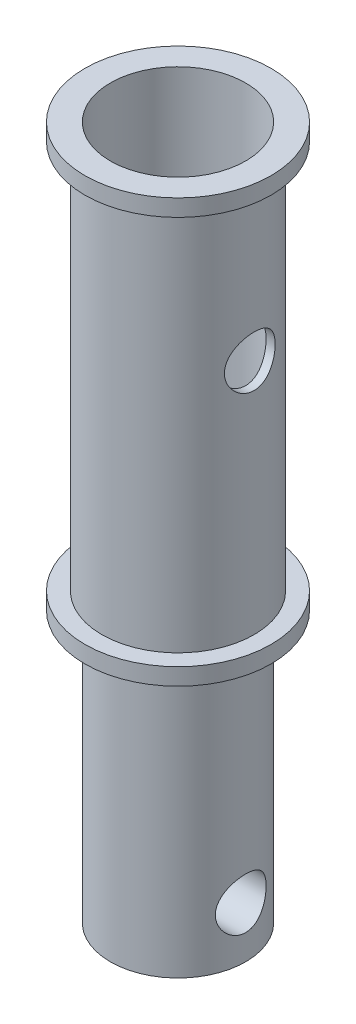
ISO-10303-21;
HEADER;
FILE_DESCRIPTION(('STEP AP214'),'2;1');
FILE_NAME('part.step','',(''),(''),'','','');
FILE_SCHEMA(('AUTOMOTIVE_DESIGN { 1 0 10303 214 1 1 1 1 }'));
ENDSEC;
DATA;
#1=APPLICATION_CONTEXT('core data for automotive mechanical design processes');
#2=APPLICATION_PROTOCOL_DEFINITION('international standard','automotive_design',2000,#1);
#3=PRODUCT_CONTEXT('',#1,'mechanical');
#4=PRODUCT('Part','Part','',(#3));
#5=PRODUCT_RELATED_PRODUCT_CATEGORY('part','',(#4));
#6=PRODUCT_DEFINITION_FORMATION('','',#4);
#7=PRODUCT_DEFINITION_CONTEXT('part definition',#1,'design');
#8=PRODUCT_DEFINITION('design','',#6,#7);
#9=PRODUCT_DEFINITION_SHAPE('','',#8);
#10=(LENGTH_UNIT() NAMED_UNIT(*) SI_UNIT(.MILLI.,.METRE.));
#11=(NAMED_UNIT(*) PLANE_ANGLE_UNIT() SI_UNIT($,.RADIAN.));
#12=(NAMED_UNIT(*) SI_UNIT($,.STERADIAN.) SOLID_ANGLE_UNIT());
#13=UNCERTAINTY_MEASURE_WITH_UNIT(LENGTH_MEASURE(1.E-05),#10,'distance_accuracy_value','');
#14=(GEOMETRIC_REPRESENTATION_CONTEXT(3) GLOBAL_UNCERTAINTY_ASSIGNED_CONTEXT((#13)) GLOBAL_UNIT_ASSIGNED_CONTEXT((#10,
#11,#12)) REPRESENTATION_CONTEXT('',''));
#15=CARTESIAN_POINT('',(0.,0.,0.));
#16=DIRECTION('',(0.,0.,1.));
#17=DIRECTION('',(1.,0.,0.));
#18=AXIS2_PLACEMENT_3D('',#15,#16,#17);
#19=CARTESIAN_POINT('',(0.,25.,0.));
#20=DIRECTION('',(0.,-1.,0.));
#21=DIRECTION('',(0.,0.,-1.));
#22=AXIS2_PLACEMENT_3D('',#19,#20,#21);
#23=CYLINDRICAL_SURFACE('',#22,4.5);
#24=CARTESIAN_POINT('',(-4.24264068711928,15.,-1.5));
#25=CARTESIAN_POINT('',(-4.24264041795651,15.0817022622541,-1.50000038692157));
#26=CARTESIAN_POINT('',(-4.24502653936286,15.1634021997354,-1.49330217552828));
#27=CARTESIAN_POINT('',(-4.25426361121882,15.3243816314914,-1.46677669753321));
#28=CARTESIAN_POINT('',(-4.26111529713283,15.4036607248087,-1.4469472682526));
#29=CARTESIAN_POINT('',(-4.27842305533187,15.5574403394959,-1.39493322852736));
#30=CARTESIAN_POINT('',(-4.28887205956983,15.6319498941641,-1.36277283210487));
#31=CARTESIAN_POINT('',(-4.31218683015487,15.7745400728219,-1.28709244266207));
#32=CARTESIAN_POINT('',(-4.32505312955418,15.8426192738304,-1.24356994329027));
#33=CARTESIAN_POINT('',(-4.3523173411121,15.9730799435075,-1.14457671966432));
#34=CARTESIAN_POINT('',(-4.36675342266966,16.0351731430076,-1.08873651206688));
#35=CARTESIAN_POINT('',(-4.39520797201504,16.149310201837,-0.967481500821593));
#36=CARTESIAN_POINT('',(-4.40922637243442,16.2013524473736,-0.902065162578564));
#37=CARTESIAN_POINT('',(-4.43570800382698,16.2952183459944,-0.761406761947516));
#38=CARTESIAN_POINT('',(-4.44812111552408,16.3367399559269,-0.685952866836789));
#39=CARTESIAN_POINT('',(-4.46954380156474,16.4063873776913,-0.528646834481211));
#40=CARTESIAN_POINT('',(-4.47855429304502,16.4345167997654,-0.446796428530818));
#41=CARTESIAN_POINT('',(-4.49188613147861,16.4756037819486,-0.282043226150241));
#42=CARTESIAN_POINT('',(-4.49635972166341,16.4890551693855,-0.199276132279451));
#43=CARTESIAN_POINT('',(-4.5006541232737,16.501974440041,-0.0325468122361348));
#44=CARTESIAN_POINT('',(-4.50047613394335,16.5014459274786,0.0514151003158411));
#45=CARTESIAN_POINT('',(-4.49559059428104,16.486733618151,0.214655272790728));
#46=CARTESIAN_POINT('',(-4.49106097132703,16.4730862072882,0.293988072887503));
#47=CARTESIAN_POINT('',(-4.47820451009571,16.4334105285293,0.449165158233243));
#48=CARTESIAN_POINT('',(-4.46987741446672,16.4073814215304,0.525009206668765));
#49=CARTESIAN_POINT('',(-4.45013505439938,16.3433680240408,0.672228712263021));
#50=CARTESIAN_POINT('',(-4.43868063786404,16.3052310921798,0.743532331453498));
#51=CARTESIAN_POINT('',(-4.41387589557997,16.2182104418274,0.878886488290755));
#52=CARTESIAN_POINT('',(-4.40052504300777,16.16932373501,0.942935001577155));
#53=CARTESIAN_POINT('',(-4.37259287776335,16.0594884098089,1.06515129982786));
#54=CARTESIAN_POINT('',(-4.35798322759,15.9980802632318,1.12290023560133));
#55=CARTESIAN_POINT('',(-4.32971002867667,15.866326911416,1.22741588939384));
#56=CARTESIAN_POINT('',(-4.31604662597175,15.7959803314301,1.27418091490951));
#57=CARTESIAN_POINT('',(-4.29105787703296,15.6470195615769,1.3559811825641));
#58=CARTESIAN_POINT('',(-4.27976864008232,15.5683018029483,1.39083969547657));
#59=CARTESIAN_POINT('',(-4.26122476317448,15.4056429086006,1.44666478994926));
#60=CARTESIAN_POINT('',(-4.25396843251835,15.3217039781673,1.46763719363329));
#61=CARTESIAN_POINT('',(-4.24469454453105,15.1550424668991,1.49424192313571));
#62=CARTESIAN_POINT('',(-4.24245540472709,15.0724358628814,1.50052364325862));
#63=CARTESIAN_POINT('',(-4.24285008094201,14.9073357763244,1.49940815836741));
#64=CARTESIAN_POINT('',(-4.24548301189152,14.8248422759629,1.49201343784089));
#65=CARTESIAN_POINT('',(-4.25510427134068,14.6652645514333,1.46433847732775));
#66=CARTESIAN_POINT('',(-4.2619398816089,14.588091854774,1.44450959097083));
#67=CARTESIAN_POINT('',(-4.27902830506905,14.4381845906409,1.39307079384089));
#68=CARTESIAN_POINT('',(-4.2892817240236,14.3654508126138,1.36145879454519));
#69=CARTESIAN_POINT('',(-4.31245316393576,14.2239293687296,1.28621151110835));
#70=CARTESIAN_POINT('',(-4.32544538498415,14.1553400360373,1.24222667753773));
#71=CARTESIAN_POINT('',(-4.35248653096476,14.0262809214244,1.14387844583635));
#72=CARTESIAN_POINT('',(-4.36653576665699,13.9658135420082,1.08951198824818));
#73=CARTESIAN_POINT('',(-4.39492557956765,13.8517080238641,0.968837558850484));
#74=CARTESIAN_POINT('',(-4.40924765366843,13.7985384149717,0.902080905819977));
#75=CARTESIAN_POINT('',(-4.43590277419665,13.7041257864779,0.760240937100386));
#76=CARTESIAN_POINT('',(-4.44823589126543,13.6628823432564,0.685157917296828));
#77=CARTESIAN_POINT('',(-4.46946608715904,13.5938698427074,0.529169793648442));
#78=CARTESIAN_POINT('',(-4.47838545006797,13.5660130842779,0.448306684981794));
#79=CARTESIAN_POINT('',(-4.49187916256662,13.5244083869098,0.282687698769024));
#80=CARTESIAN_POINT('',(-4.49645508051028,13.5106553551792,0.197933237930834));
#81=CARTESIAN_POINT('',(-4.50062794854384,13.4981068835915,0.0312230037900605));
#82=CARTESIAN_POINT('',(-4.50044880134159,13.4986388191014,-0.0506770858800288));
#83=CARTESIAN_POINT('',(-4.49568294779097,13.5129859622196,-0.213166717500262));
#84=CARTESIAN_POINT('',(-4.49109659900364,13.5268000922292,-0.293756365228586));
#85=CARTESIAN_POINT('',(-4.47811372431618,13.5668733518639,-0.450063179148089));
#86=CARTESIAN_POINT('',(-4.46977887541723,13.5929313230294,-0.525837406369185));
#87=CARTESIAN_POINT('',(-4.45015741056742,13.6565662966457,-0.671967526409694));
#88=CARTESIAN_POINT('',(-4.43887026072025,13.6941453827955,-0.742322436213649));
#89=CARTESIAN_POINT('',(-4.41398803241821,13.781354268153,-0.878451024463179));
#90=CARTESIAN_POINT('',(-4.4003230873789,13.8313780280725,-0.943959377336412));
#91=CARTESIAN_POINT('',(-4.37239483187819,13.9413860867343,-1.06587153940864));
#92=CARTESIAN_POINT('',(-4.35813133159646,14.0013735633941,-1.12227243243689));
#93=CARTESIAN_POINT('',(-4.32994919738397,14.1324140333804,-1.22661271324968));
#94=CARTESIAN_POINT('',(-4.31606591982946,14.203808266465,-1.27413444899685));
#95=CARTESIAN_POINT('',(-4.29090289984523,14.3540016403542,-1.35647151495167));
#96=CARTESIAN_POINT('',(-4.27962247741874,14.4327988395445,-1.39129016522921));
#97=CARTESIAN_POINT('',(-4.26152001309772,14.5919427360234,-1.44576574230625));
#98=CARTESIAN_POINT('',(-4.25451949285773,14.6720583952881,-1.46603686372428));
#99=CARTESIAN_POINT('',(-4.24508075309277,14.8347840757001,-1.4931514802239));
#100=CARTESIAN_POINT('',(-4.24264095926192,14.9173932261161,-1.49999960879489));
#101=CARTESIAN_POINT('',(-4.24264068711928,15.,-1.5));
#102=B_SPLINE_CURVE_WITH_KNOTS('',3,(#24,#25,#26,#27,#28,#29,#30,#31,#32,#33,#34,#35,#36,#37,
#38,#39,#40,#41,#42,#43,#44,#45,#46,#47,#48,#49,#50,#51,#52,#53,#54,#55,#56,#57,#58,#59,#60,#61,
#62,#63,#64,#65,#66,#67,#68,#69,#70,#71,#72,#73,#74,#75,#76,#77,#78,#79,#80,#81,#82,#83,#84,#85,
#86,#87,#88,#89,#90,#91,#92,#93,#94,#95,#96,#97,#98,#99,#100,#101),.UNSPECIFIED.,.T.,.F.,(4,2,2,
2,2,2,2,2,2,2,2,2,2,2,2,2,2,2,2,2,2,2,2,2,2,2,2,2,2,2,2,2,2,2,2,2,2,2,4),(0.,0.244800877199035,
0.489642082522746,0.734004941251242,0.978421749278164,1.23152006141352,1.48465897757982,
1.74440259215486,2.00407614580184,2.25471478147402,2.50528879953491,2.74603507238354,
2.98679766283855,3.23072482290503,3.47471987811033,3.73020261545877,3.98572469418159,
4.24488959763007,4.50394577031476,4.75131437043211,4.99863803752403,5.23746593649716,
5.47633618716971,5.72278286600124,5.96930228489743,6.22768212253191,6.48605278132851,
6.74270686782829,6.99926824502787,7.24377127013005,7.48825446011224,7.72885434057197,
7.96949776141416,8.21903279277503,8.468647566455,8.72803354100769,8.98735167396852,
9.23494818240588,9.48245920782248),.UNSPECIFIED.);
#103=CARTESIAN_POINT('',(-4.24264068711928,15.,-1.5));
#104=VERTEX_POINT('',#103);
#105=EDGE_CURVE('E85',#104,#104,#102,.T.);
#106=ORIENTED_EDGE('',*,*,#105,.T.);
#107=EDGE_LOOP('',(#106));
#108=FACE_BOUND('',#107,.T.);
#109=CARTESIAN_POINT('',(4.24264068711928,15.,-1.5));
#110=CARTESIAN_POINT('',(4.24264041795651,14.9182977377459,-1.50000038692157));
#111=CARTESIAN_POINT('',(4.24502653936286,14.8365978002646,-1.49330217552828));
#112=CARTESIAN_POINT('',(4.25426361121882,14.6756183685086,-1.46677669753321));
#113=CARTESIAN_POINT('',(4.26111529713283,14.5963392751913,-1.4469472682526));
#114=CARTESIAN_POINT('',(4.27842305533187,14.4425596605041,-1.39493322852736));
#115=CARTESIAN_POINT('',(4.28887205956983,14.3680501058359,-1.36277283210487));
#116=CARTESIAN_POINT('',(4.31218683015487,14.2254599271781,-1.28709244266207));
#117=CARTESIAN_POINT('',(4.32505312955418,14.1573807261696,-1.24356994329027));
#118=CARTESIAN_POINT('',(4.3523173411121,14.0269200564925,-1.14457671966432));
#119=CARTESIAN_POINT('',(4.36675342266966,13.9648268569924,-1.08873651206688));
#120=CARTESIAN_POINT('',(4.39520797201504,13.850689798163,-0.967481500821593));
#121=CARTESIAN_POINT('',(4.40922637243442,13.7986475526264,-0.902065162578564));
#122=CARTESIAN_POINT('',(4.43570800382698,13.7047816540056,-0.761406761947516));
#123=CARTESIAN_POINT('',(4.44812111552408,13.6632600440731,-0.685952866836788));
#124=CARTESIAN_POINT('',(4.46954380156474,13.5936126223087,-0.528646834481211));
#125=CARTESIAN_POINT('',(4.47855429304502,13.5654832002346,-0.446796428530818));
#126=CARTESIAN_POINT('',(4.49188613147861,13.5243962180514,-0.282043226150241));
#127=CARTESIAN_POINT('',(4.49635972166341,13.5109448306145,-0.199276132279451));
#128=CARTESIAN_POINT('',(4.5006541232737,13.498025559959,-0.0325468122361353));
#129=CARTESIAN_POINT('',(4.50047613394335,13.4985540725214,0.05141510031584));
#130=CARTESIAN_POINT('',(4.49559059428104,13.513266381849,0.214655272790727));
#131=CARTESIAN_POINT('',(4.49106097132703,13.5269137927118,0.293988072887501));
#132=CARTESIAN_POINT('',(4.4782045100957,13.5665894714707,0.449165158233242));
#133=CARTESIAN_POINT('',(4.46987741446672,13.5926185784696,0.525009206668764));
#134=CARTESIAN_POINT('',(4.45013505439938,13.6566319759592,0.672228712263021));
#135=CARTESIAN_POINT('',(4.43868063786404,13.6947689078202,0.743532331453498));
#136=CARTESIAN_POINT('',(4.41387589557997,13.7817895581726,0.878886488290755));
#137=CARTESIAN_POINT('',(4.40052504300777,13.83067626499,0.942935001577155));
#138=CARTESIAN_POINT('',(4.37259287776335,13.9405115901911,1.06515129982786));
#139=CARTESIAN_POINT('',(4.35798322759,14.0019197367682,1.12290023560133));
#140=CARTESIAN_POINT('',(4.32971002867667,14.133673088584,1.22741588939383));
#141=CARTESIAN_POINT('',(4.31604662597175,14.2040196685699,1.27418091490951));
#142=CARTESIAN_POINT('',(4.29105787703296,14.3529804384231,1.3559811825641));
#143=CARTESIAN_POINT('',(4.27976864008232,14.4316981970517,1.39083969547657));
#144=CARTESIAN_POINT('',(4.26122476317448,14.5943570913994,1.44666478994926));
#145=CARTESIAN_POINT('',(4.25396843251835,14.6782960218327,1.46763719363329));
#146=CARTESIAN_POINT('',(4.24469454453105,14.8449575331009,1.49424192313571));
#147=CARTESIAN_POINT('',(4.24245540472709,14.9275641371186,1.50052364325862));
#148=CARTESIAN_POINT('',(4.24285008094201,15.0926642236756,1.49940815836741));
#149=CARTESIAN_POINT('',(4.24548301189152,15.1751577240371,1.49201343784089));
#150=CARTESIAN_POINT('',(4.25510427134068,15.3347354485667,1.46433847732775));
#151=CARTESIAN_POINT('',(4.2619398816089,15.411908145226,1.44450959097083));
#152=CARTESIAN_POINT('',(4.27902830506905,15.5618154093591,1.39307079384089));
#153=CARTESIAN_POINT('',(4.2892817240236,15.6345491873863,1.36145879454519));
#154=CARTESIAN_POINT('',(4.31245316393576,15.7760706312704,1.28621151110835));
#155=CARTESIAN_POINT('',(4.32544538498415,15.8446599639627,1.24222667753773));
#156=CARTESIAN_POINT('',(4.35248653096476,15.9737190785756,1.14387844583635));
#157=CARTESIAN_POINT('',(4.36653576665699,16.0341864579918,1.08951198824818));
#158=CARTESIAN_POINT('',(4.39492557956765,16.148291976136,0.968837558850484));
#159=CARTESIAN_POINT('',(4.40924765366843,16.2014615850283,0.902080905819977));
#160=CARTESIAN_POINT('',(4.43590277419665,16.2958742135221,0.760240937100386));
#161=CARTESIAN_POINT('',(4.44823589126543,16.3371176567436,0.685157917296828));
#162=CARTESIAN_POINT('',(4.46946608715904,16.4061301572926,0.529169793648443));
#163=CARTESIAN_POINT('',(4.47838545006797,16.4339869157221,0.448306684981795));
#164=CARTESIAN_POINT('',(4.49187916256662,16.4755916130902,0.282687698769026));
#165=CARTESIAN_POINT('',(4.49645508051028,16.4893446448208,0.197933237930835));
#166=CARTESIAN_POINT('',(4.50062794854384,16.5018931164085,0.0312230037900614));
#167=CARTESIAN_POINT('',(4.50044880134159,16.5013611808986,-0.0506770858800279));
#168=CARTESIAN_POINT('',(4.49568294779097,16.4870140377804,-0.213166717500261));
#169=CARTESIAN_POINT('',(4.49109659900364,16.4731999077708,-0.293756365228586));
#170=CARTESIAN_POINT('',(4.47811372431618,16.4331266481361,-0.450063179148089));
#171=CARTESIAN_POINT('',(4.46977887541723,16.4070686769706,-0.525837406369184));
#172=CARTESIAN_POINT('',(4.45015741056742,16.3434337033543,-0.671967526409693));
#173=CARTESIAN_POINT('',(4.43887026072025,16.3058546172045,-0.742322436213649));
#174=CARTESIAN_POINT('',(4.41398803241821,16.218645731847,-0.87845102446318));
#175=CARTESIAN_POINT('',(4.4003230873789,16.1686219719275,-0.943959377336413));
#176=CARTESIAN_POINT('',(4.37239483187819,16.0586139132657,-1.06587153940864));
#177=CARTESIAN_POINT('',(4.35813133159646,15.9986264366059,-1.12227243243689));
#178=CARTESIAN_POINT('',(4.32994919738397,15.8675859666196,-1.22661271324968));
#179=CARTESIAN_POINT('',(4.31606591982946,15.796191733535,-1.27413444899685));
#180=CARTESIAN_POINT('',(4.29090289984523,15.6459983596458,-1.35647151495167));
#181=CARTESIAN_POINT('',(4.27962247741874,15.5672011604555,-1.39129016522921));
#182=CARTESIAN_POINT('',(4.26152001309772,15.4080572639766,-1.44576574230625));
#183=CARTESIAN_POINT('',(4.25451949285773,15.327941604712,-1.46603686372428));
#184=CARTESIAN_POINT('',(4.24508075309277,15.1652159242999,-1.4931514802239));
#185=CARTESIAN_POINT('',(4.24264095926192,15.0826067738839,-1.49999960879489));
#186=CARTESIAN_POINT('',(4.24264068711928,15.,-1.5));
#187=B_SPLINE_CURVE_WITH_KNOTS('',3,(#109,#110,#111,#112,#113,#114,#115,#116,#117,#118,#119,
#120,#121,#122,#123,#124,#125,#126,#127,#128,#129,#130,#131,#132,#133,#134,#135,#136,#137,#138,
#139,#140,#141,#142,#143,#144,#145,#146,#147,#148,#149,#150,#151,#152,#153,#154,#155,#156,#157,
#158,#159,#160,#161,#162,#163,#164,#165,#166,#167,#168,#169,#170,#171,#172,#173,#174,#175,#176,
#177,#178,#179,#180,#181,#182,#183,#184,#185,#186),.UNSPECIFIED.,.T.,.F.,(4,2,2,2,2,2,2,2,2,2,2,
2,2,2,2,2,2,2,2,2,2,2,2,2,2,2,2,2,2,2,2,2,2,2,2,2,2,2,4),(0.,0.244800877199035,
0.489642082522746,0.734004941251245,0.978421749278165,1.23152006141352,1.48465897757982,
1.74440259215486,2.00407614580184,2.25471478147402,2.50528879953491,2.74603507238354,
2.98679766283855,3.23072482290503,3.47471987811033,3.73020261545877,3.98572469418159,
4.24488959763007,4.50394577031475,4.75131437043211,4.99863803752403,5.23746593649716,
5.47633618716971,5.72278286600124,5.96930228489743,6.22768212253191,6.4860527813285,
6.74270686782829,6.99926824502787,7.24377127013005,7.48825446011224,7.72885434057197,
7.96949776141416,8.21903279277503,8.468647566455,8.72803354100769,8.98735167396852,
9.23494818240588,9.48245920782248),.UNSPECIFIED.);
#188=CARTESIAN_POINT('',(4.24264068711928,15.,-1.5));
#189=VERTEX_POINT('',#188);
#190=EDGE_CURVE('E80',#189,#189,#187,.T.);
#191=ORIENTED_EDGE('',*,*,#190,.T.);
#192=EDGE_LOOP('',(#191));
#193=FACE_BOUND('',#192,.T.);
#194=CARTESIAN_POINT('',(0.,1.,0.));
#195=DIRECTION('',(0.,1.,0.));
#196=DIRECTION('',(0.,0.,1.));
#197=AXIS2_PLACEMENT_3D('',#194,#195,#196);
#198=CIRCLE('',#197,4.5);
#199=CARTESIAN_POINT('',(0.,1.,4.5));
#200=VERTEX_POINT('',#199);
#201=EDGE_CURVE('E124',#200,#200,#198,.F.);
#202=ORIENTED_EDGE('',*,*,#201,.F.);
#203=EDGE_LOOP('',(#202));
#204=FACE_BOUND('',#203,.T.);
#205=CARTESIAN_POINT('',(0.,24.,0.));
#206=DIRECTION('',(0.,1.,0.));
#207=DIRECTION('',(0.,0.,1.));
#208=AXIS2_PLACEMENT_3D('',#205,#206,#207);
#209=CIRCLE('',#208,4.5);
#210=CARTESIAN_POINT('',(0.,24.,4.5));
#211=VERTEX_POINT('',#210);
#212=EDGE_CURVE('E10',#211,#211,#209,.T.);
#213=ORIENTED_EDGE('',*,*,#212,.F.);
#214=EDGE_LOOP('',(#213));
#215=FACE_BOUND('',#214,.T.);
#216=ADVANCED_FACE('F31',(#108,#193,#204,#215),#23,.T.);
#217=CARTESIAN_POINT('',(0.,1.,0.));
#218=DIRECTION('',(0.,-1.,0.));
#219=DIRECTION('',(0.,0.,-1.));
#220=AXIS2_PLACEMENT_3D('',#217,#218,#219);
#221=CYLINDRICAL_SURFACE('',#220,5.5);
#222=CARTESIAN_POINT('',(0.,1.,0.));
#223=DIRECTION('',(0.,1.,0.));
#224=DIRECTION('',(0.,0.,1.));
#225=AXIS2_PLACEMENT_3D('',#222,#223,#224);
#226=CIRCLE('',#225,5.5);
#227=CARTESIAN_POINT('',(0.,1.,5.5));
#228=VERTEX_POINT('',#227);
#229=EDGE_CURVE('E134',#228,#228,#226,.T.);
#230=ORIENTED_EDGE('',*,*,#229,.F.);
#231=EDGE_LOOP('',(#230));
#232=FACE_BOUND('',#231,.T.);
#233=CARTESIAN_POINT('',(0.,0.,0.));
#234=DIRECTION('',(0.,1.,0.));
#235=DIRECTION('',(0.,0.,1.));
#236=AXIS2_PLACEMENT_3D('',#233,#234,#235);
#237=CIRCLE('',#236,5.5);
#238=CARTESIAN_POINT('',(0.,0.,5.5));
#239=VERTEX_POINT('',#238);
#240=EDGE_CURVE('E130',#239,#239,#237,.T.);
#241=ORIENTED_EDGE('',*,*,#240,.T.);
#242=EDGE_LOOP('',(#241));
#243=FACE_BOUND('',#242,.T.);
#244=ADVANCED_FACE('F33',(#232,#243),#221,.T.);
#245=CARTESIAN_POINT('',(0.,1.,0.));
#246=DIRECTION('',(0.,1.,0.));
#247=DIRECTION('',(0.,0.,1.));
#248=AXIS2_PLACEMENT_3D('',#245,#246,#247);
#249=PLANE('',#248);
#250=ORIENTED_EDGE('',*,*,#201,.T.);
#251=EDGE_LOOP('',(#250));
#252=FACE_BOUND('',#251,.T.);
#253=ORIENTED_EDGE('',*,*,#229,.T.);
#254=EDGE_LOOP('',(#253));
#255=FACE_BOUND('',#254,.T.);
#256=ADVANCED_FACE('F161',(#252,#255),#249,.T.);
#257=CARTESIAN_POINT('',(0.,0.,0.));
#258=DIRECTION('',(0.,1.,0.));
#259=DIRECTION('',(0.,0.,1.));
#260=AXIS2_PLACEMENT_3D('',#257,#258,#259);
#261=PLANE('',#260);
#262=ORIENTED_EDGE('',*,*,#240,.F.);
#263=EDGE_LOOP('',(#262));
#264=FACE_BOUND('',#263,.T.);
#265=CARTESIAN_POINT('',(0.,0.,0.));
#266=DIRECTION('',(0.,1.,0.));
#267=DIRECTION('',(0.,0.,1.));
#268=AXIS2_PLACEMENT_3D('',#265,#266,#267);
#269=CIRCLE('',#268,4.);
#270=CARTESIAN_POINT('',(0.,0.,4.));
#271=VERTEX_POINT('',#270);
#272=EDGE_CURVE('E131',#271,#271,#269,.T.);
#273=ORIENTED_EDGE('',*,*,#272,.T.);
#274=EDGE_LOOP('',(#273));
#275=FACE_BOUND('',#274,.T.);
#276=ADVANCED_FACE('F153',(#264,#275),#261,.F.);
#277=CARTESIAN_POINT('',(0.,-16.,0.));
#278=DIRECTION('',(0.,1.,0.));
#279=DIRECTION('',(0.,0.,1.));
#280=AXIS2_PLACEMENT_3D('',#277,#278,#279);
#281=CYLINDRICAL_SURFACE('',#280,4.);
#282=CARTESIAN_POINT('',(-3.70809924354783,-13.,-1.5));
#283=CARTESIAN_POINT('',(-3.70809640633806,-13.0810074837208,-1.50000304106109));
#284=CARTESIAN_POINT('',(-3.71078260240986,-13.1619949225036,-1.49341597549487));
#285=CARTESIAN_POINT('',(-3.72116159304967,-13.3215280829132,-1.46736187895468));
#286=CARTESIAN_POINT('',(-3.72885423767112,-13.400073877595,-1.44789523373263));
#287=CARTESIAN_POINT('',(-3.748254802809,-13.5523753716135,-1.39689657610574));
#288=CARTESIAN_POINT('',(-3.7599530956926,-13.6261420566511,-1.36539347266348));
#289=CARTESIAN_POINT('',(-3.78603134206598,-13.7673718968188,-1.29131856742698));
#290=CARTESIAN_POINT('',(-3.80041210067323,-13.8348331502825,-1.24874344095039));
#291=CARTESIAN_POINT('',(-3.83103574665713,-13.9648903116228,-1.15146661374162));
#292=CARTESIAN_POINT('',(-3.84733341923603,-14.0271285296294,-1.09630381213306));
#293=CARTESIAN_POINT('',(-3.87949750628547,-14.1417228146715,-0.976395839778926));
#294=CARTESIAN_POINT('',(-3.89536382814785,-14.1940767737419,-0.911648630256679));
#295=CARTESIAN_POINT('',(-3.92552873936553,-14.2891395122956,-0.7716946551776));
#296=CARTESIAN_POINT('',(-3.93975561223505,-14.3314594747159,-0.696206947538028));
#297=CARTESIAN_POINT('',(-3.96438007973848,-14.4026511725249,-0.538555771965247));
#298=CARTESIAN_POINT('',(-3.97477900217006,-14.431527571992,-0.456394630933536));
#299=CARTESIAN_POINT('',(-3.9901869710344,-14.4737578957746,-0.291489341676832));
#300=CARTESIAN_POINT('',(-3.99540915214774,-14.4877276274405,-0.208923197281596));
#301=CARTESIAN_POINT('',(-4.0006401410794,-14.501721200945,-0.0424643637947861));
#302=CARTESIAN_POINT('',(-4.00065064414902,-14.5017495776187,0.0414278850628328));
#303=CARTESIAN_POINT('',(-3.99559265903894,-14.4882182385348,0.203743543064476));
#304=CARTESIAN_POINT('',(-3.99077541996683,-14.4753307020512,0.2822321782669));
#305=CARTESIAN_POINT('',(-3.97693274932263,-14.4374640847744,0.435839217984391));
#306=CARTESIAN_POINT('',(-3.96790701975578,-14.412484147738,0.510957383430298));
#307=CARTESIAN_POINT('',(-3.94637769167531,-14.3508295483242,0.656989017303104));
#308=CARTESIAN_POINT('',(-3.93382539470077,-14.3139899947316,0.727825392287308));
#309=CARTESIAN_POINT('',(-3.90651310225279,-14.2298079030706,0.862486607957558));
#310=CARTESIAN_POINT('',(-3.8917523951284,-14.1824619769824,0.926309176932322));
#311=CARTESIAN_POINT('',(-3.86052529655816,-14.0753727137168,1.04909048680094));
#312=CARTESIAN_POINT('',(-3.84400963763883,-14.0150660843496,1.10754614526348));
#313=CARTESIAN_POINT('',(-3.81182460645722,-13.8854070066784,1.21370395569342));
#314=CARTESIAN_POINT('',(-3.79615544748847,-13.8160522934134,1.261403406929));
#315=CARTESIAN_POINT('',(-3.76712703500335,-13.6682805325372,1.34565611808151));
#316=CARTESIAN_POINT('',(-3.75382677150277,-13.5896965063139,1.38193847851831));
#317=CARTESIAN_POINT('',(-3.73172438629002,-13.4269037748324,1.44056464441501));
#318=CARTESIAN_POINT('',(-3.72291976205783,-13.3426982284063,1.46291620605595));
#319=CARTESIAN_POINT('',(-3.71139597222848,-13.176024037684,1.49190191709668));
#320=CARTESIAN_POINT('',(-3.70836785241537,-13.0937158944639,1.49933521158966));
#321=CARTESIAN_POINT('',(-3.70786539525016,-12.9289906432583,1.50057885636272));
#322=CARTESIAN_POINT('',(-3.71038967003987,-12.8465735676475,1.49439261093762));
#323=CARTESIAN_POINT('',(-3.72039381629735,-12.6880700777123,1.46929733520157));
#324=CARTESIAN_POINT('',(-3.72763276216449,-12.6118688642353,1.45100618334224));
#325=CARTESIAN_POINT('',(-3.74596487046362,-12.4636520552798,1.40299774640637));
#326=CARTESIAN_POINT('',(-3.75705882250173,-12.3916373208319,1.37327812034623));
#327=CARTESIAN_POINT('',(-3.7823624311608,-12.2508355619238,1.30200292275278));
#328=CARTESIAN_POINT('',(-3.79667328892065,-12.1822707078627,1.26004545177047));
#329=CARTESIAN_POINT('',(-3.82662814294291,-12.052871018274,1.16591317862479));
#330=CARTESIAN_POINT('',(-3.84227262594077,-11.9920390253754,1.11373463696435));
#331=CARTESIAN_POINT('',(-3.87433046553184,-11.8758316268049,0.996727340900938));
#332=CARTESIAN_POINT('',(-3.89072969357028,-11.8210465912312,0.931306341491062));
#333=CARTESIAN_POINT('',(-3.92149874963302,-11.7231616324106,0.79179747175315));
#334=CARTESIAN_POINT('',(-3.93586857107664,-11.6800617470542,0.717709573322673));
#335=CARTESIAN_POINT('',(-3.96094985704552,-11.6070539438004,0.563016329468476));
#336=CARTESIAN_POINT('',(-3.9716738133801,-11.5771008762074,0.482434433064626));
#337=CARTESIAN_POINT('',(-3.98829436712571,-11.5313435861501,0.316881887523254));
#338=CARTESIAN_POINT('',(-3.99419323299412,-11.5155327145776,0.231913320723592));
#339=CARTESIAN_POINT('',(-4.00028407317073,-11.4992255972452,0.0653355852738152));
#340=CARTESIAN_POINT('',(-4.00078860953764,-11.497890516941,-0.0161807680608455));
#341=CARTESIAN_POINT('',(-3.99684889809223,-11.5084151594454,-0.178226786412424));
#342=CARTESIAN_POINT('',(-3.9924052471313,-11.5202732908859,-0.258756569245257));
#343=CARTESIAN_POINT('',(-3.97921089603771,-11.5562588514936,-0.414548248377126));
#344=CARTESIAN_POINT('',(-3.97056791378017,-11.5800799058784,-0.489890731068835));
#345=CARTESIAN_POINT('',(-3.9498778362099,-11.6390100133844,-0.63551547300639));
#346=CARTESIAN_POINT('',(-3.93783009655664,-11.6741212033048,-0.705796771275543));
#347=CARTESIAN_POINT('',(-3.91090618300074,-11.7563139435048,-0.842540176994413));
#348=CARTESIAN_POINT('',(-3.89593240108828,-11.8038366405141,-0.90871754884685));
#349=CARTESIAN_POINT('',(-3.86499507694844,-11.9088078301876,-1.03241734752336));
#350=CARTESIAN_POINT('',(-3.84903118274027,-11.9662598658079,-1.0899366712559));
#351=CARTESIAN_POINT('',(-3.81688129739175,-12.0930641316451,-1.19781214236196));
#352=CARTESIAN_POINT('',(-3.8007280534916,-12.1628844021543,-1.24762999816025));
#353=CARTESIAN_POINT('',(-3.77098325003638,-12.3104158695733,-1.33484709556843));
#354=CARTESIAN_POINT('',(-3.75739195631216,-12.3881278840535,-1.37224504878157));
#355=CARTESIAN_POINT('',(-3.73402269853266,-12.5529556809754,-1.4346588697426));
#356=CARTESIAN_POINT('',(-3.7244380329086,-12.6403343665118,-1.45906002899523));
#357=CARTESIAN_POINT('',(-3.71147994336315,-12.8184852719558,-1.49172356722079));
#358=CARTESIAN_POINT('',(-3.70810242179736,-12.90925521271,-1.49999659339571));
#359=CARTESIAN_POINT('',(-3.70809924354783,-13.,-1.5));
#360=B_SPLINE_CURVE_WITH_KNOTS('',3,(#282,#283,#284,#285,#286,#287,#288,#289,#290,#291,#292,
#293,#294,#295,#296,#297,#298,#299,#300,#301,#302,#303,#304,#305,#306,#307,#308,#309,#310,#311,
#312,#313,#314,#315,#316,#317,#318,#319,#320,#321,#322,#323,#324,#325,#326,#327,#328,#329,#330,
#331,#332,#333,#334,#335,#336,#337,#338,#339,#340,#341,#342,#343,#344,#345,#346,#347,#348,#349,
#350,#351,#352,#353,#354,#355,#356,#357,#358,#359),.UNSPECIFIED.,.T.,.F.,(4,2,2,2,2,2,2,2,2,2,2,
2,2,2,2,2,2,2,2,2,2,2,2,2,2,2,2,2,2,2,2,2,2,2,2,2,2,2,4),(0.,0.242684541416169,
0.485361814598854,0.727459856757031,0.969630679682934,1.22274652401128,1.47591628822983,
1.73770072136421,1.9993942638133,2.24980018489679,2.50012465404857,2.73806472803194,
2.97602165263335,3.21744131210668,3.45893893628976,3.71456675065874,3.97025867827334,
4.23162592252966,4.49284751635474,4.73965657740485,4.98640395388884,5.22143845928198,
5.45652113429526,5.70041561005821,5.94439948466355,6.20385016993624,6.46330169650178,
6.72185508890168,6.98028685560126,7.22365720549936,7.46699820319479,7.7044027400389,
7.94185223512831,8.18928323676987,8.43680270894964,8.69738599542079,8.95799630544242,
9.23003178870926,9.50188762323053),.UNSPECIFIED.);
#361=CARTESIAN_POINT('',(-3.70809924354783,-13.,-1.5));
#362=VERTEX_POINT('',#361);
#363=EDGE_CURVE('E52',#362,#362,#360,.T.);
#364=ORIENTED_EDGE('',*,*,#363,.F.);
#365=EDGE_LOOP('',(#364));
#366=FACE_BOUND('',#365,.T.);
#367=CARTESIAN_POINT('',(3.70809924354783,-13.,-1.5));
#368=CARTESIAN_POINT('',(3.70809640633806,-12.9189925162792,-1.50000304106109));
#369=CARTESIAN_POINT('',(3.71078260240986,-12.8380050774964,-1.49341597549487));
#370=CARTESIAN_POINT('',(3.72116159304967,-12.6784719170868,-1.46736187895468));
#371=CARTESIAN_POINT('',(3.72885423767112,-12.599926122405,-1.44789523373263));
#372=CARTESIAN_POINT('',(3.748254802809,-12.4476246283865,-1.39689657610574));
#373=CARTESIAN_POINT('',(3.7599530956926,-12.3738579433489,-1.36539347266348));
#374=CARTESIAN_POINT('',(3.78603134206598,-12.2326281031812,-1.29131856742698));
#375=CARTESIAN_POINT('',(3.80041210067323,-12.1651668497175,-1.24874344095039));
#376=CARTESIAN_POINT('',(3.83103574665713,-12.0351096883772,-1.15146661374162));
#377=CARTESIAN_POINT('',(3.84733341923603,-11.9728714703706,-1.09630381213306));
#378=CARTESIAN_POINT('',(3.87949750628547,-11.8582771853285,-0.976395839778928));
#379=CARTESIAN_POINT('',(3.89536382814785,-11.8059232262581,-0.911648630256681));
#380=CARTESIAN_POINT('',(3.92552873936553,-11.7108604877044,-0.771694655177602));
#381=CARTESIAN_POINT('',(3.93975561223505,-11.6685405252841,-0.696206947538029));
#382=CARTESIAN_POINT('',(3.96438007973847,-11.5973488274751,-0.538555771965248));
#383=CARTESIAN_POINT('',(3.97477900217006,-11.568472428008,-0.456394630933537));
#384=CARTESIAN_POINT('',(3.9901869710344,-11.5262421042254,-0.291489341676833));
#385=CARTESIAN_POINT('',(3.99540915214774,-11.5122723725595,-0.208923197281597));
#386=CARTESIAN_POINT('',(4.0006401410794,-11.498278799055,-0.0424643637947868));
#387=CARTESIAN_POINT('',(4.00065064414902,-11.4982504223813,0.0414278850628323));
#388=CARTESIAN_POINT('',(3.99559265903894,-11.5117817614652,0.203743543064476));
#389=CARTESIAN_POINT('',(3.99077541996683,-11.5246692979488,0.2822321782669));
#390=CARTESIAN_POINT('',(3.97693274932263,-11.5625359152256,0.435839217984391));
#391=CARTESIAN_POINT('',(3.96790701975578,-11.587515852262,0.510957383430299));
#392=CARTESIAN_POINT('',(3.94637769167531,-11.6491704516758,0.656989017303104));
#393=CARTESIAN_POINT('',(3.93382539470077,-11.6860100052684,0.727825392287309));
#394=CARTESIAN_POINT('',(3.90651310225279,-11.7701920969294,0.862486607957559));
#395=CARTESIAN_POINT('',(3.8917523951284,-11.8175380230176,0.926309176932323));
#396=CARTESIAN_POINT('',(3.86052529655816,-11.9246272862832,1.04909048680094));
#397=CARTESIAN_POINT('',(3.84400963763883,-11.9849339156504,1.10754614526348));
#398=CARTESIAN_POINT('',(3.81182460645722,-12.1145929933216,1.21370395569342));
#399=CARTESIAN_POINT('',(3.79615544748847,-12.1839477065866,1.261403406929));
#400=CARTESIAN_POINT('',(3.76712703500335,-12.3317194674628,1.34565611808152));
#401=CARTESIAN_POINT('',(3.75382677150277,-12.4103034936861,1.38193847851831));
#402=CARTESIAN_POINT('',(3.73172438629002,-12.5730962251676,1.44056464441501));
#403=CARTESIAN_POINT('',(3.72291976205783,-12.6573017715937,1.46291620605595));
#404=CARTESIAN_POINT('',(3.71139597222848,-12.823975962316,1.49190191709668));
#405=CARTESIAN_POINT('',(3.70836785241537,-12.9062841055361,1.49933521158966));
#406=CARTESIAN_POINT('',(3.70786539525016,-13.0710093567417,1.50057885636272));
#407=CARTESIAN_POINT('',(3.71038967003987,-13.1534264323525,1.49439261093762));
#408=CARTESIAN_POINT('',(3.72039381629735,-13.3119299222877,1.46929733520157));
#409=CARTESIAN_POINT('',(3.72763276216449,-13.3881311357647,1.45100618334224));
#410=CARTESIAN_POINT('',(3.74596487046362,-13.5363479447202,1.40299774640637));
#411=CARTESIAN_POINT('',(3.75705882250173,-13.6083626791681,1.37327812034623));
#412=CARTESIAN_POINT('',(3.7823624311608,-13.7491644380762,1.30200292275278));
#413=CARTESIAN_POINT('',(3.79667328892065,-13.8177292921373,1.26004545177047));
#414=CARTESIAN_POINT('',(3.82662814294291,-13.947128981726,1.16591317862479));
#415=CARTESIAN_POINT('',(3.84227262594077,-14.0079609746246,1.11373463696435));
#416=CARTESIAN_POINT('',(3.87433046553184,-14.1241683731951,0.996727340900938));
#417=CARTESIAN_POINT('',(3.89072969357027,-14.1789534087688,0.931306341491062));
#418=CARTESIAN_POINT('',(3.92149874963302,-14.2768383675894,0.791797471753151));
#419=CARTESIAN_POINT('',(3.93586857107664,-14.3199382529458,0.717709573322674));
#420=CARTESIAN_POINT('',(3.96094985704552,-14.3929460561996,0.563016329468477));
#421=CARTESIAN_POINT('',(3.9716738133801,-14.4228991237926,0.482434433064627));
#422=CARTESIAN_POINT('',(3.98829436712571,-14.4686564138499,0.316881887523255));
#423=CARTESIAN_POINT('',(3.99419323299412,-14.4844672854224,0.231913320723593));
#424=CARTESIAN_POINT('',(4.00028407317073,-14.5007744027548,0.0653355852738162));
#425=CARTESIAN_POINT('',(4.00078860953764,-14.502109483059,-0.0161807680608445));
#426=CARTESIAN_POINT('',(3.99684889809224,-14.4915848405546,-0.178226786412423));
#427=CARTESIAN_POINT('',(3.9924052471313,-14.4797267091141,-0.258756569245256));
#428=CARTESIAN_POINT('',(3.97921089603771,-14.4437411485064,-0.414548248377126));
#429=CARTESIAN_POINT('',(3.97056791378017,-14.4199200941216,-0.489890731068834));
#430=CARTESIAN_POINT('',(3.9498778362099,-14.3609899866156,-0.63551547300639));
#431=CARTESIAN_POINT('',(3.93783009655664,-14.3258787966952,-0.705796771275542));
#432=CARTESIAN_POINT('',(3.91090618300074,-14.2436860564952,-0.842540176994412));
#433=CARTESIAN_POINT('',(3.89593240108828,-14.1961633594859,-0.908717548846849));
#434=CARTESIAN_POINT('',(3.86499507694844,-14.0911921698124,-1.03241734752336));
#435=CARTESIAN_POINT('',(3.84903118274027,-14.0337401341921,-1.0899366712559));
#436=CARTESIAN_POINT('',(3.81688129739175,-13.9069358683549,-1.19781214236196));
#437=CARTESIAN_POINT('',(3.8007280534916,-13.8371155978457,-1.24762999816025));
#438=CARTESIAN_POINT('',(3.77098325003638,-13.6895841304267,-1.33484709556843));
#439=CARTESIAN_POINT('',(3.75739195631216,-13.6118721159465,-1.37224504878157));
#440=CARTESIAN_POINT('',(3.73402269853266,-13.4470443190246,-1.4346588697426));
#441=CARTESIAN_POINT('',(3.7244380329086,-13.3596656334882,-1.45906002899523));
#442=CARTESIAN_POINT('',(3.71147994336315,-13.1815147280442,-1.49172356722079));
#443=CARTESIAN_POINT('',(3.70810242179736,-13.09074478729,-1.49999659339571));
#444=CARTESIAN_POINT('',(3.70809924354783,-13.,-1.5));
#445=B_SPLINE_CURVE_WITH_KNOTS('',3,(#367,#368,#369,#370,#371,#372,#373,#374,#375,#376,#377,
#378,#379,#380,#381,#382,#383,#384,#385,#386,#387,#388,#389,#390,#391,#392,#393,#394,#395,#396,
#397,#398,#399,#400,#401,#402,#403,#404,#405,#406,#407,#408,#409,#410,#411,#412,#413,#414,#415,
#416,#417,#418,#419,#420,#421,#422,#423,#424,#425,#426,#427,#428,#429,#430,#431,#432,#433,#434,
#435,#436,#437,#438,#439,#440,#441,#442,#443,#444),.UNSPECIFIED.,.T.,.F.,(4,2,2,2,2,2,2,2,2,2,2,
2,2,2,2,2,2,2,2,2,2,2,2,2,2,2,2,2,2,2,2,2,2,2,2,2,2,2,4),(0.,0.242684541416169,
0.485361814598854,0.727459856757031,0.969630679682932,1.22274652401128,1.47591628822983,
1.73770072136421,1.9993942638133,2.24980018489679,2.50012465404857,2.73806472803194,
2.97602165263335,3.21744131210668,3.45893893628976,3.71456675065874,3.97025867827335,
4.23162592252967,4.49284751635474,4.73965657740485,4.98640395388884,5.22143845928199,
5.45652113429526,5.70041561005821,5.94439948466355,6.20385016993624,6.46330169650178,
6.72185508890168,6.98028685560127,7.22365720549936,7.4669982031948,7.70440274003891,
7.94185223512831,8.18928323676987,8.43680270894965,8.69738599542079,8.95799630544242,
9.23003178870927,9.50188762323053),.UNSPECIFIED.);
#446=CARTESIAN_POINT('',(3.70809924354783,-13.,-1.5));
#447=VERTEX_POINT('',#446);
#448=EDGE_CURVE('E49',#447,#447,#445,.T.);
#449=ORIENTED_EDGE('',*,*,#448,.F.);
#450=EDGE_LOOP('',(#449));
#451=FACE_BOUND('',#450,.T.);
#452=CARTESIAN_POINT('',(0.,-16.,0.));
#453=DIRECTION('',(0.,1.,0.));
#454=DIRECTION('',(0.,0.,1.));
#455=AXIS2_PLACEMENT_3D('',#452,#453,#454);
#456=CIRCLE('',#455,4.);
#457=CARTESIAN_POINT('',(0.,-16.,4.));
#458=VERTEX_POINT('',#457);
#459=EDGE_CURVE('E127',#458,#458,#456,.T.);
#460=ORIENTED_EDGE('',*,*,#459,.T.);
#461=EDGE_LOOP('',(#460));
#462=FACE_BOUND('',#461,.T.);
#463=ORIENTED_EDGE('',*,*,#272,.F.);
#464=EDGE_LOOP('',(#463));
#465=FACE_BOUND('',#464,.T.);
#466=ADVANCED_FACE('F142',(#366,#451,#462,#465),#281,.T.);
#467=CARTESIAN_POINT('',(0.,-16.,0.));
#468=DIRECTION('',(0.,1.,0.));
#469=DIRECTION('',(0.,0.,1.));
#470=AXIS2_PLACEMENT_3D('',#467,#468,#469);
#471=PLANE('',#470);
#472=ORIENTED_EDGE('',*,*,#459,.F.);
#473=EDGE_LOOP('',(#472));
#474=FACE_BOUND('',#473,.T.);
#475=ADVANCED_FACE('F108',(#474),#471,.F.);
#476=CARTESIAN_POINT('',(-9.,-13.,0.));
#477=DIRECTION('',(1.,0.,0.));
#478=DIRECTION('',(0.,0.,-1.));
#479=AXIS2_PLACEMENT_3D('',#476,#477,#478);
#480=CYLINDRICAL_SURFACE('',#479,1.5);
#481=ORIENTED_EDGE('',*,*,#363,.T.);
#482=EDGE_LOOP('',(#481));
#483=FACE_BOUND('',#482,.T.);
#484=ORIENTED_EDGE('',*,*,#448,.T.);
#485=EDGE_LOOP('',(#484));
#486=FACE_BOUND('',#485,.T.);
#487=ADVANCED_FACE('F100',(#483,#486),#480,.F.);
#488=CARTESIAN_POINT('',(0.,25.,0.));
#489=DIRECTION('',(0.,-1.,0.));
#490=DIRECTION('',(0.,0.,-1.));
#491=AXIS2_PLACEMENT_3D('',#488,#489,#490);
#492=CYLINDRICAL_SURFACE('',#491,5.5);
#493=CARTESIAN_POINT('',(0.,25.,0.));
#494=DIRECTION('',(0.,1.,0.));
#495=DIRECTION('',(0.,0.,1.));
#496=AXIS2_PLACEMENT_3D('',#493,#494,#495);
#497=CIRCLE('',#496,5.5);
#498=CARTESIAN_POINT('',(0.,25.,5.5));
#499=VERTEX_POINT('',#498);
#500=EDGE_CURVE('E113',#499,#499,#497,.T.);
#501=ORIENTED_EDGE('',*,*,#500,.F.);
#502=EDGE_LOOP('',(#501));
#503=FACE_BOUND('',#502,.T.);
#504=CARTESIAN_POINT('',(0.,24.,0.));
#505=DIRECTION('',(0.,1.,0.));
#506=DIRECTION('',(0.,0.,1.));
#507=AXIS2_PLACEMENT_3D('',#504,#505,#506);
#508=CIRCLE('',#507,5.5);
#509=CARTESIAN_POINT('',(0.,24.,5.5));
#510=VERTEX_POINT('',#509);
#511=EDGE_CURVE('E116',#510,#510,#508,.T.);
#512=ORIENTED_EDGE('',*,*,#511,.T.);
#513=EDGE_LOOP('',(#512));
#514=FACE_BOUND('',#513,.T.);
#515=ADVANCED_FACE('F98',(#503,#514),#492,.T.);
#516=CARTESIAN_POINT('',(0.,24.,0.));
#517=DIRECTION('',(0.,1.,0.));
#518=DIRECTION('',(0.,0.,1.));
#519=AXIS2_PLACEMENT_3D('',#516,#517,#518);
#520=PLANE('',#519);
#521=ORIENTED_EDGE('',*,*,#212,.T.);
#522=EDGE_LOOP('',(#521));
#523=FACE_BOUND('',#522,.T.);
#524=ORIENTED_EDGE('',*,*,#511,.F.);
#525=EDGE_LOOP('',(#524));
#526=FACE_BOUND('',#525,.T.);
#527=ADVANCED_FACE('F73',(#523,#526),#520,.F.);
#528=CARTESIAN_POINT('',(0.,1.,0.));
#529=DIRECTION('',(0.,1.,0.));
#530=DIRECTION('',(0.,0.,1.));
#531=AXIS2_PLACEMENT_3D('',#528,#529,#530);
#532=CIRCLE('',#531,4.);
#533=CARTESIAN_POINT('',(0.,1.,4.));
#534=VERTEX_POINT('',#533);
#535=EDGE_CURVE('E44',#534,#534,#532,.F.);
#536=ORIENTED_EDGE('',*,*,#535,.F.);
#537=EDGE_LOOP('',(#536));
#538=FACE_BOUND('',#537,.T.);
#539=ADVANCED_FACE('F106',(#538),#249,.T.);
#540=CARTESIAN_POINT('',(0.,25.,0.));
#541=DIRECTION('',(0.,-1.,0.));
#542=DIRECTION('',(0.,0.,-1.));
#543=AXIS2_PLACEMENT_3D('',#540,#541,#542);
#544=CYLINDRICAL_SURFACE('',#543,4.);
#545=CARTESIAN_POINT('',(-3.70809924354783,15.,-1.5));
#546=CARTESIAN_POINT('',(-3.70809640633806,15.0810074837208,-1.50000304106109));
#547=CARTESIAN_POINT('',(-3.71078260240986,15.1619949225036,-1.49341597549487));
#548=CARTESIAN_POINT('',(-3.72116159304967,15.3215280829132,-1.46736187895468));
#549=CARTESIAN_POINT('',(-3.72885423767112,15.400073877595,-1.44789523373263));
#550=CARTESIAN_POINT('',(-3.748254802809,15.5523753716135,-1.39689657610574));
#551=CARTESIAN_POINT('',(-3.7599530956926,15.6261420566511,-1.36539347266348));
#552=CARTESIAN_POINT('',(-3.78603134206598,15.7673718968188,-1.29131856742697));
#553=CARTESIAN_POINT('',(-3.80041210067323,15.8348331502825,-1.24874344095038));
#554=CARTESIAN_POINT('',(-3.83103574665713,15.9648903116228,-1.15146661374162));
#555=CARTESIAN_POINT('',(-3.84733341923603,16.0271285296294,-1.09630381213306));
#556=CARTESIAN_POINT('',(-3.87949750628547,16.1417228146715,-0.976395839778924));
#557=CARTESIAN_POINT('',(-3.89536382814785,16.1940767737419,-0.911648630256677));
#558=CARTESIAN_POINT('',(-3.92552873936553,16.2891395122956,-0.771694655177597));
#559=CARTESIAN_POINT('',(-3.93975561223505,16.3314594747159,-0.696206947538025));
#560=CARTESIAN_POINT('',(-3.96438007973848,16.4026511725249,-0.538555771965245));
#561=CARTESIAN_POINT('',(-3.97477900217006,16.431527571992,-0.456394630933533));
#562=CARTESIAN_POINT('',(-3.9901869710344,16.4737578957746,-0.291489341676829));
#563=CARTESIAN_POINT('',(-3.99540915214774,16.4877276274405,-0.208923197281593));
#564=CARTESIAN_POINT('',(-4.0006401410794,16.501721200945,-0.042464363794783));
#565=CARTESIAN_POINT('',(-4.00065064414902,16.5017495776187,0.0414278850628361));
#566=CARTESIAN_POINT('',(-3.99559265903894,16.4882182385348,0.203743543064479));
#567=CARTESIAN_POINT('',(-3.99077541996683,16.4753307020512,0.282232178266903));
#568=CARTESIAN_POINT('',(-3.97693274932263,16.4374640847744,0.435839217984394));
#569=CARTESIAN_POINT('',(-3.96790701975577,16.412484147738,0.510957383430301));
#570=CARTESIAN_POINT('',(-3.9463776916753,16.3508295483242,0.656989017303106));
#571=CARTESIAN_POINT('',(-3.93382539470077,16.3139899947316,0.727825392287311));
#572=CARTESIAN_POINT('',(-3.90651310225279,16.2298079030706,0.862486607957561));
#573=CARTESIAN_POINT('',(-3.8917523951284,16.1824619769824,0.926309176932324));
#574=CARTESIAN_POINT('',(-3.86052529655816,16.0753727137168,1.04909048680094));
#575=CARTESIAN_POINT('',(-3.84400963763883,16.0150660843496,1.10754614526348));
#576=CARTESIAN_POINT('',(-3.81182460645722,15.8854070066784,1.21370395569343));
#577=CARTESIAN_POINT('',(-3.79615544748847,15.8160522934134,1.261403406929));
#578=CARTESIAN_POINT('',(-3.76712703500335,15.6682805325372,1.34565611808152));
#579=CARTESIAN_POINT('',(-3.75382677150277,15.5896965063139,1.38193847851831));
#580=CARTESIAN_POINT('',(-3.73172438629002,15.4269037748324,1.44056464441501));
#581=CARTESIAN_POINT('',(-3.72291976205783,15.3426982284063,1.46291620605595));
#582=CARTESIAN_POINT('',(-3.71139597222848,15.176024037684,1.49190191709668));
#583=CARTESIAN_POINT('',(-3.70836785241537,15.0937158944639,1.49933521158966));
#584=CARTESIAN_POINT('',(-3.70786539525016,14.9289906432583,1.50057885636272));
#585=CARTESIAN_POINT('',(-3.71038967003987,14.8465735676475,1.49439261093762));
#586=CARTESIAN_POINT('',(-3.72039381629735,14.6880700777123,1.46929733520157));
#587=CARTESIAN_POINT('',(-3.72763276216449,14.6118688642353,1.45100618334225));
#588=CARTESIAN_POINT('',(-3.74596487046362,14.4636520552798,1.40299774640637));
#589=CARTESIAN_POINT('',(-3.75705882250173,14.3916373208319,1.37327812034623));
#590=CARTESIAN_POINT('',(-3.7823624311608,14.2508355619238,1.30200292275278));
#591=CARTESIAN_POINT('',(-3.79667328892065,14.1822707078627,1.26004545177047));
#592=CARTESIAN_POINT('',(-3.82662814294291,14.052871018274,1.16591317862479));
#593=CARTESIAN_POINT('',(-3.84227262594077,13.9920390253754,1.11373463696435));
#594=CARTESIAN_POINT('',(-3.87433046553184,13.8758316268049,0.996727340900937));
#595=CARTESIAN_POINT('',(-3.89072969357028,13.8210465912312,0.93130634149106));
#596=CARTESIAN_POINT('',(-3.92149874963302,13.7231616324106,0.791797471753149));
#597=CARTESIAN_POINT('',(-3.93586857107664,13.6800617470542,0.717709573322671));
#598=CARTESIAN_POINT('',(-3.96094985704552,13.6070539438004,0.563016329468474));
#599=CARTESIAN_POINT('',(-3.9716738133801,13.5771008762074,0.482434433064624));
#600=CARTESIAN_POINT('',(-3.98829436712571,13.5313435861501,0.316881887523253));
#601=CARTESIAN_POINT('',(-3.99419323299413,13.5155327145776,0.231913320723591));
#602=CARTESIAN_POINT('',(-4.00028407317073,13.4992255972452,0.0653355852738132));
#603=CARTESIAN_POINT('',(-4.00078860953764,13.497890516941,-0.0161807680608477));
#604=CARTESIAN_POINT('',(-3.99684889809223,13.5084151594454,-0.178226786412426));
#605=CARTESIAN_POINT('',(-3.9924052471313,13.5202732908859,-0.258756569245259));
#606=CARTESIAN_POINT('',(-3.97921089603771,13.5562588514936,-0.414548248377128));
#607=CARTESIAN_POINT('',(-3.97056791378017,13.5800799058784,-0.489890731068836));
#608=CARTESIAN_POINT('',(-3.9498778362099,13.6390100133844,-0.635515473006392));
#609=CARTESIAN_POINT('',(-3.93783009655664,13.6741212033048,-0.705796771275545));
#610=CARTESIAN_POINT('',(-3.91090618300074,13.7563139435048,-0.842540176994414));
#611=CARTESIAN_POINT('',(-3.89593240108828,13.8038366405141,-0.90871754884685));
#612=CARTESIAN_POINT('',(-3.86499507694844,13.9088078301876,-1.03241734752336));
#613=CARTESIAN_POINT('',(-3.84903118274027,13.9662598658079,-1.0899366712559));
#614=CARTESIAN_POINT('',(-3.81688129739175,14.0930641316451,-1.19781214236196));
#615=CARTESIAN_POINT('',(-3.8007280534916,14.1628844021543,-1.24762999816025));
#616=CARTESIAN_POINT('',(-3.77098325003638,14.3104158695733,-1.33484709556843));
#617=CARTESIAN_POINT('',(-3.75739195631216,14.3881278840535,-1.37224504878157));
#618=CARTESIAN_POINT('',(-3.73402269853266,14.5529556809754,-1.4346588697426));
#619=CARTESIAN_POINT('',(-3.7244380329086,14.6403343665118,-1.45906002899523));
#620=CARTESIAN_POINT('',(-3.71147994336315,14.8184852719558,-1.49172356722079));
#621=CARTESIAN_POINT('',(-3.70810242179736,14.90925521271,-1.49999659339571));
#622=CARTESIAN_POINT('',(-3.70809924354783,15.,-1.5));
#623=B_SPLINE_CURVE_WITH_KNOTS('',3,(#545,#546,#547,#548,#549,#550,#551,#552,#553,#554,#555,
#556,#557,#558,#559,#560,#561,#562,#563,#564,#565,#566,#567,#568,#569,#570,#571,#572,#573,#574,
#575,#576,#577,#578,#579,#580,#581,#582,#583,#584,#585,#586,#587,#588,#589,#590,#591,#592,#593,
#594,#595,#596,#597,#598,#599,#600,#601,#602,#603,#604,#605,#606,#607,#608,#609,#610,#611,#612,
#613,#614,#615,#616,#617,#618,#619,#620,#621,#622),.UNSPECIFIED.,.T.,.F.,(4,2,2,2,2,2,2,2,2,2,2,
2,2,2,2,2,2,2,2,2,2,2,2,2,2,2,2,2,2,2,2,2,2,2,2,2,2,2,4),(0.,0.242684541416171,
0.485361814598856,0.727459856757031,0.969630679682937,1.22274652401128,1.47591628822983,
1.73770072136421,1.9993942638133,2.24980018489679,2.50012465404857,2.73806472803195,
2.97602165263336,3.21744131210668,3.45893893628976,3.71456675065875,3.97025867827335,
4.23162592252967,4.49284751635474,4.73965657740485,4.98640395388884,5.22143845928199,
5.45652113429526,5.70041561005822,5.94439948466355,6.20385016993624,6.46330169650178,
6.72185508890169,6.98028685560127,7.22365720549936,7.4669982031948,7.70440274003891,
7.94185223512831,8.18928323676987,8.43680270894965,8.69738599542079,8.95799630544243,
9.23003178870926,9.50188762323053),.UNSPECIFIED.);
#624=CARTESIAN_POINT('',(-3.70809924354783,15.,-1.5));
#625=VERTEX_POINT('',#624);
#626=EDGE_CURVE('E35',#625,#625,#623,.T.);
#627=ORIENTED_EDGE('',*,*,#626,.F.);
#628=EDGE_LOOP('',(#627));
#629=FACE_BOUND('',#628,.T.);
#630=CARTESIAN_POINT('',(3.70809924354783,15.,-1.5));
#631=CARTESIAN_POINT('',(3.70809640633806,14.9189925162792,-1.50000304106109));
#632=CARTESIAN_POINT('',(3.71078260240986,14.8380050774964,-1.49341597549487));
#633=CARTESIAN_POINT('',(3.72116159304967,14.6784719170868,-1.46736187895468));
#634=CARTESIAN_POINT('',(3.72885423767112,14.599926122405,-1.44789523373263));
#635=CARTESIAN_POINT('',(3.748254802809,14.4476246283865,-1.39689657610574));
#636=CARTESIAN_POINT('',(3.7599530956926,14.3738579433489,-1.36539347266348));
#637=CARTESIAN_POINT('',(3.78603134206598,14.2326281031812,-1.29131856742698));
#638=CARTESIAN_POINT('',(3.80041210067323,14.1651668497175,-1.24874344095039));
#639=CARTESIAN_POINT('',(3.83103574665713,14.0351096883772,-1.15146661374162));
#640=CARTESIAN_POINT('',(3.84733341923603,13.9728714703706,-1.09630381213306));
#641=CARTESIAN_POINT('',(3.87949750628547,13.8582771853285,-0.976395839778926));
#642=CARTESIAN_POINT('',(3.89536382814785,13.8059232262581,-0.91164863025668));
#643=CARTESIAN_POINT('',(3.92552873936553,13.7108604877044,-0.7716946551776));
#644=CARTESIAN_POINT('',(3.93975561223505,13.6685405252841,-0.696206947538028));
#645=CARTESIAN_POINT('',(3.96438007973848,13.5973488274751,-0.538555771965248));
#646=CARTESIAN_POINT('',(3.97477900217006,13.568472428008,-0.456394630933536));
#647=CARTESIAN_POINT('',(3.9901869710344,13.5262421042254,-0.291489341676832));
#648=CARTESIAN_POINT('',(3.99540915214774,13.5122723725595,-0.208923197281597));
#649=CARTESIAN_POINT('',(4.0006401410794,13.498278799055,-0.0424643637947866));
#650=CARTESIAN_POINT('',(4.00065064414902,13.4982504223813,0.0414278850628324));
#651=CARTESIAN_POINT('',(3.99559265903894,13.5117817614652,0.203743543064475));
#652=CARTESIAN_POINT('',(3.99077541996683,13.5246692979488,0.282232178266899));
#653=CARTESIAN_POINT('',(3.97693274932263,13.5625359152256,0.435839217984391));
#654=CARTESIAN_POINT('',(3.96790701975578,13.587515852262,0.510957383430298));
#655=CARTESIAN_POINT('',(3.94637769167531,13.6491704516758,0.656989017303104));
#656=CARTESIAN_POINT('',(3.93382539470077,13.6860100052684,0.727825392287309));
#657=CARTESIAN_POINT('',(3.90651310225279,13.7701920969294,0.86248660795756));
#658=CARTESIAN_POINT('',(3.8917523951284,13.8175380230176,0.926309176932323));
#659=CARTESIAN_POINT('',(3.86052529655816,13.9246272862832,1.04909048680094));
#660=CARTESIAN_POINT('',(3.84400963763883,13.9849339156504,1.10754614526348));
#661=CARTESIAN_POINT('',(3.81182460645722,14.1145929933216,1.21370395569342));
#662=CARTESIAN_POINT('',(3.79615544748847,14.1839477065866,1.261403406929));
#663=CARTESIAN_POINT('',(3.76712703500335,14.3317194674628,1.34565611808151));
#664=CARTESIAN_POINT('',(3.75382677150277,14.4103034936861,1.38193847851831));
#665=CARTESIAN_POINT('',(3.73172438629002,14.5730962251676,1.44056464441501));
#666=CARTESIAN_POINT('',(3.72291976205783,14.6573017715937,1.46291620605595));
#667=CARTESIAN_POINT('',(3.71139597222848,14.823975962316,1.49190191709668));
#668=CARTESIAN_POINT('',(3.70836785241537,14.9062841055361,1.49933521158966));
#669=CARTESIAN_POINT('',(3.70786539525016,15.0710093567417,1.50057885636272));
#670=CARTESIAN_POINT('',(3.71038967003987,15.1534264323525,1.49439261093762));
#671=CARTESIAN_POINT('',(3.72039381629735,15.3119299222877,1.46929733520157));
#672=CARTESIAN_POINT('',(3.72763276216449,15.3881311357647,1.45100618334225));
#673=CARTESIAN_POINT('',(3.74596487046361,15.5363479447202,1.40299774640638));
#674=CARTESIAN_POINT('',(3.75705882250172,15.6083626791681,1.37327812034623));
#675=CARTESIAN_POINT('',(3.7823624311608,15.7491644380762,1.30200292275278));
#676=CARTESIAN_POINT('',(3.79667328892065,15.8177292921373,1.26004545177047));
#677=CARTESIAN_POINT('',(3.82662814294291,15.947128981726,1.16591317862479));
#678=CARTESIAN_POINT('',(3.84227262594077,16.0079609746246,1.11373463696435));
#679=CARTESIAN_POINT('',(3.87433046553184,16.1241683731951,0.996727340900939));
#680=CARTESIAN_POINT('',(3.89072969357027,16.1789534087688,0.931306341491062));
#681=CARTESIAN_POINT('',(3.92149874963302,16.2768383675894,0.791797471753151));
#682=CARTESIAN_POINT('',(3.93586857107664,16.3199382529458,0.717709573322673));
#683=CARTESIAN_POINT('',(3.96094985704552,16.3929460561996,0.563016329468477));
#684=CARTESIAN_POINT('',(3.9716738133801,16.4228991237926,0.482434433064628));
#685=CARTESIAN_POINT('',(3.98829436712571,16.4686564138499,0.316881887523257));
#686=CARTESIAN_POINT('',(3.99419323299412,16.4844672854224,0.231913320723595));
#687=CARTESIAN_POINT('',(4.00028407317073,16.5007744027548,0.0653355852738177));
#688=CARTESIAN_POINT('',(4.00078860953764,16.502109483059,-0.0161807680608431));
#689=CARTESIAN_POINT('',(3.99684889809224,16.4915848405546,-0.178226786412422));
#690=CARTESIAN_POINT('',(3.9924052471313,16.4797267091141,-0.258756569245255));
#691=CARTESIAN_POINT('',(3.97921089603771,16.4437411485064,-0.414548248377124));
#692=CARTESIAN_POINT('',(3.97056791378017,16.4199200941216,-0.489890731068833));
#693=CARTESIAN_POINT('',(3.9498778362099,16.3609899866156,-0.635515473006388));
#694=CARTESIAN_POINT('',(3.93783009655664,16.3258787966952,-0.705796771275541));
#695=CARTESIAN_POINT('',(3.91090618300074,16.2436860564952,-0.842540176994412));
#696=CARTESIAN_POINT('',(3.89593240108828,16.1961633594859,-0.90871754884685));
#697=CARTESIAN_POINT('',(3.86499507694844,16.0911921698124,-1.03241734752336));
#698=CARTESIAN_POINT('',(3.84903118274027,16.0337401341921,-1.0899366712559));
#699=CARTESIAN_POINT('',(3.81688129739175,15.9069358683549,-1.19781214236196));
#700=CARTESIAN_POINT('',(3.8007280534916,15.8371155978457,-1.24762999816025));
#701=CARTESIAN_POINT('',(3.77098325003638,15.6895841304267,-1.33484709556843));
#702=CARTESIAN_POINT('',(3.75739195631216,15.6118721159465,-1.37224504878157));
#703=CARTESIAN_POINT('',(3.73402269853266,15.4470443190246,-1.4346588697426));
#704=CARTESIAN_POINT('',(3.7244380329086,15.3596656334882,-1.45906002899523));
#705=CARTESIAN_POINT('',(3.71147994336315,15.1815147280442,-1.49172356722079));
#706=CARTESIAN_POINT('',(3.70810242179736,15.09074478729,-1.49999659339571));
#707=CARTESIAN_POINT('',(3.70809924354783,15.,-1.5));
#708=B_SPLINE_CURVE_WITH_KNOTS('',3,(#630,#631,#632,#633,#634,#635,#636,#637,#638,#639,#640,
#641,#642,#643,#644,#645,#646,#647,#648,#649,#650,#651,#652,#653,#654,#655,#656,#657,#658,#659,
#660,#661,#662,#663,#664,#665,#666,#667,#668,#669,#670,#671,#672,#673,#674,#675,#676,#677,#678,
#679,#680,#681,#682,#683,#684,#685,#686,#687,#688,#689,#690,#691,#692,#693,#694,#695,#696,#697,
#698,#699,#700,#701,#702,#703,#704,#705,#706,#707),.UNSPECIFIED.,.T.,.F.,(4,2,2,2,2,2,2,2,2,2,2,
2,2,2,2,2,2,2,2,2,2,2,2,2,2,2,2,2,2,2,2,2,2,2,2,2,2,2,4),(0.,0.242684541416169,
0.485361814598854,0.72745985675703,0.969630679682933,1.22274652401128,1.47591628822983,
1.73770072136421,1.9993942638133,2.24980018489679,2.50012465404857,2.73806472803194,
2.97602165263335,3.21744131210668,3.45893893628976,3.71456675065874,3.97025867827335,
4.23162592252966,4.49284751635474,4.73965657740485,4.98640395388884,5.22143845928198,
5.45652113429526,5.70041561005821,5.94439948466355,6.20385016993624,6.46330169650178,
6.72185508890168,6.98028685560127,7.22365720549936,7.4669982031948,7.7044027400389,
7.94185223512831,8.18928323676987,8.43680270894965,8.69738599542079,8.95799630544242,
9.23003178870926,9.50188762323054),.UNSPECIFIED.);
#709=CARTESIAN_POINT('',(3.70809924354783,15.,-1.5));
#710=VERTEX_POINT('',#709);
#711=EDGE_CURVE('E59',#710,#710,#708,.T.);
#712=ORIENTED_EDGE('',*,*,#711,.F.);
#713=EDGE_LOOP('',(#712));
#714=FACE_BOUND('',#713,.T.);
#715=ORIENTED_EDGE('',*,*,#535,.T.);
#716=EDGE_LOOP('',(#715));
#717=FACE_BOUND('',#716,.T.);
#718=CARTESIAN_POINT('',(0.,25.,0.));
#719=DIRECTION('',(0.,1.,0.));
#720=DIRECTION('',(0.,0.,1.));
#721=AXIS2_PLACEMENT_3D('',#718,#719,#720);
#722=CIRCLE('',#721,4.);
#723=CARTESIAN_POINT('',(0.,25.,4.));
#724=VERTEX_POINT('',#723);
#725=EDGE_CURVE('E119',#724,#724,#722,.T.);
#726=ORIENTED_EDGE('',*,*,#725,.T.);
#727=EDGE_LOOP('',(#726));
#728=FACE_BOUND('',#727,.T.);
#729=ADVANCED_FACE('F64',(#629,#714,#717,#728),#544,.F.);
#730=CARTESIAN_POINT('',(0.,25.,0.));
#731=DIRECTION('',(0.,1.,0.));
#732=DIRECTION('',(0.,0.,1.));
#733=AXIS2_PLACEMENT_3D('',#730,#731,#732);
#734=PLANE('',#733);
#735=ORIENTED_EDGE('',*,*,#725,.F.);
#736=EDGE_LOOP('',(#735));
#737=FACE_BOUND('',#736,.T.);
#738=ORIENTED_EDGE('',*,*,#500,.T.);
#739=EDGE_LOOP('',(#738));
#740=FACE_BOUND('',#739,.T.);
#741=ADVANCED_FACE('F94',(#737,#740),#734,.T.);
#742=CARTESIAN_POINT('',(-7.5,15.,0.));
#743=DIRECTION('',(1.,0.,0.));
#744=DIRECTION('',(0.,0.,-1.));
#745=AXIS2_PLACEMENT_3D('',#742,#743,#744);
#746=CYLINDRICAL_SURFACE('',#745,1.5);
#747=ORIENTED_EDGE('',*,*,#711,.T.);
#748=EDGE_LOOP('',(#747));
#749=FACE_BOUND('',#748,.T.);
#750=ORIENTED_EDGE('',*,*,#190,.F.);
#751=EDGE_LOOP('',(#750));
#752=FACE_BOUND('',#751,.T.);
#753=ADVANCED_FACE('F71',(#749,#752),#746,.F.);
#754=ORIENTED_EDGE('',*,*,#626,.T.);
#755=EDGE_LOOP('',(#754));
#756=FACE_BOUND('',#755,.T.);
#757=ORIENTED_EDGE('',*,*,#105,.F.);
#758=EDGE_LOOP('',(#757));
#759=FACE_BOUND('',#758,.T.);
#760=ADVANCED_FACE('F67',(#756,#759),#746,.F.);
#761=CLOSED_SHELL('',(#216,#244,#256,#276,#466,#475,#487,#515,#527,#539,#729,#741,#753,#760));
#762=MANIFOLD_SOLID_BREP('B2',#761);
#763=ADVANCED_BREP_SHAPE_REPRESENTATION('',(#18,#762),#14);
#764=SHAPE_DEFINITION_REPRESENTATION(#9,#763);
ENDSEC;
END-ISO-10303-21;
